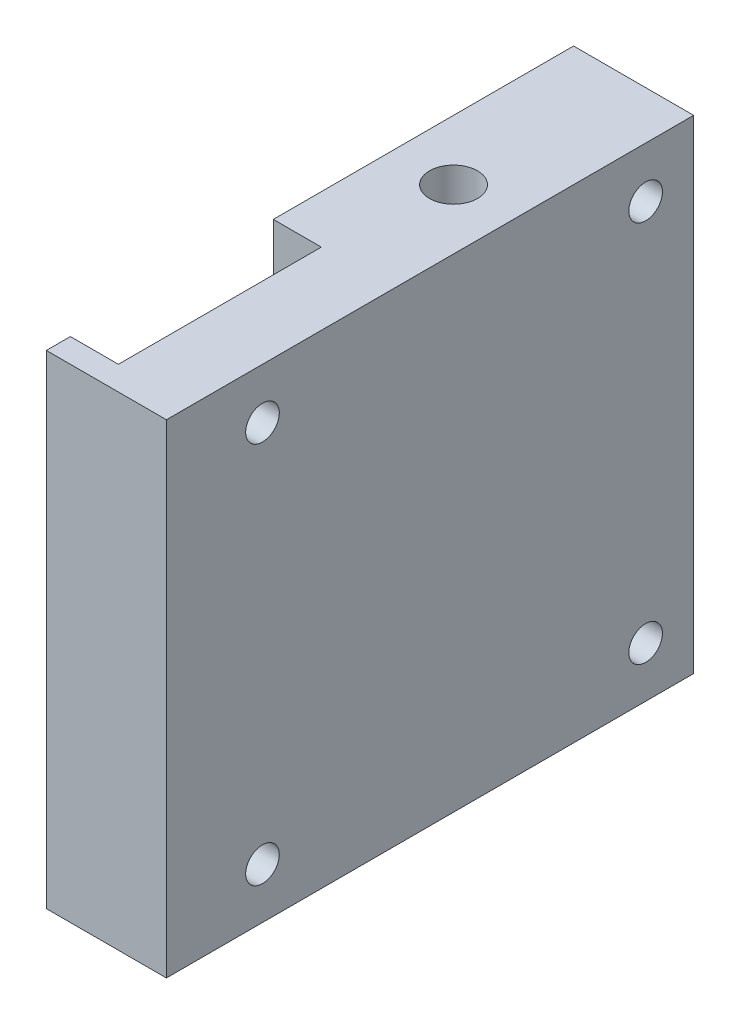
ISO-10303-21;
HEADER;
FILE_DESCRIPTION(('STEP AP214'),'2;1');
FILE_NAME('part.step','',(''),(''),'','','');
FILE_SCHEMA(('AUTOMOTIVE_DESIGN { 1 0 10303 214 1 1 1 1 }'));
ENDSEC;
DATA;
#1=APPLICATION_CONTEXT('core data for automotive mechanical design processes');
#2=APPLICATION_PROTOCOL_DEFINITION('international standard','automotive_design',2000,#1);
#3=PRODUCT_CONTEXT('',#1,'mechanical');
#4=PRODUCT('Part','Part','',(#3));
#5=PRODUCT_RELATED_PRODUCT_CATEGORY('part','',(#4));
#6=PRODUCT_DEFINITION_FORMATION('','',#4);
#7=PRODUCT_DEFINITION_CONTEXT('part definition',#1,'design');
#8=PRODUCT_DEFINITION('design','',#6,#7);
#9=PRODUCT_DEFINITION_SHAPE('','',#8);
#10=(LENGTH_UNIT() NAMED_UNIT(*) SI_UNIT(.MILLI.,.METRE.));
#11=(NAMED_UNIT(*) PLANE_ANGLE_UNIT() SI_UNIT($,.RADIAN.));
#12=(NAMED_UNIT(*) SI_UNIT($,.STERADIAN.) SOLID_ANGLE_UNIT());
#13=UNCERTAINTY_MEASURE_WITH_UNIT(LENGTH_MEASURE(1.E-05),#10,'distance_accuracy_value','');
#14=(GEOMETRIC_REPRESENTATION_CONTEXT(3) GLOBAL_UNCERTAINTY_ASSIGNED_CONTEXT((#13)) GLOBAL_UNIT_ASSIGNED_CONTEXT((#10,
#11,#12)) REPRESENTATION_CONTEXT('',''));
#15=CARTESIAN_POINT('',(0.,0.,0.));
#16=DIRECTION('',(0.,0.,1.));
#17=DIRECTION('',(1.,0.,0.));
#18=AXIS2_PLACEMENT_3D('',#15,#16,#17);
#19=CARTESIAN_POINT('',(24.4736259646391,344.184836728762,297.699454326369));
#20=DIRECTION('',(1.,0.,0.));
#21=DIRECTION('',(0.,0.,-1.));
#22=AXIS2_PLACEMENT_3D('',#19,#20,#21);
#23=CYLINDRICAL_SURFACE('',#22,1.40000000002354);
#24=CARTESIAN_POINT('',(34.4736259646391,344.184836728762,297.699454326369));
#25=DIRECTION('',(-1.,0.,0.));
#26=DIRECTION('',(0.,0.,1.));
#27=AXIS2_PLACEMENT_3D('',#24,#25,#26);
#28=CIRCLE('',#27,1.40000000002354);
#29=CARTESIAN_POINT('',(34.4736259646391,344.184836728762,299.099454326392));
#30=VERTEX_POINT('',#29);
#31=EDGE_CURVE('E187',#30,#30,#28,.T.);
#32=ORIENTED_EDGE('',*,*,#31,.F.);
#33=EDGE_LOOP('',(#32));
#34=FACE_BOUND('',#33,.T.);
#35=CARTESIAN_POINT('',(28.4736259646391,344.184836728762,297.699454326369));
#36=DIRECTION('',(-1.,0.,0.));
#37=DIRECTION('',(0.,0.,1.));
#38=AXIS2_PLACEMENT_3D('',#35,#36,#37);
#39=CIRCLE('',#38,1.40000000002354);
#40=CARTESIAN_POINT('',(28.4736259646391,344.184836728762,299.099454326392));
#41=VERTEX_POINT('',#40);
#42=EDGE_CURVE('E40',#41,#41,#39,.T.);
#43=ORIENTED_EDGE('',*,*,#42,.T.);
#44=EDGE_LOOP('',(#43));
#45=FACE_BOUND('',#44,.T.);
#46=ADVANCED_FACE('F36',(#34,#45),#23,.F.);
#47=CARTESIAN_POINT('',(24.4736259646391,312.337113745687,297.699454326369));
#48=DIRECTION('',(1.,0.,0.));
#49=DIRECTION('',(0.,0.,-1.));
#50=AXIS2_PLACEMENT_3D('',#47,#48,#49);
#51=CYLINDRICAL_SURFACE('',#50,1.40000000002354);
#52=CARTESIAN_POINT('',(34.4736259646391,312.337113745687,297.699454326369));
#53=DIRECTION('',(-1.,0.,0.));
#54=DIRECTION('',(0.,0.,-1.));
#55=AXIS2_PLACEMENT_3D('',#52,#53,#54);
#56=CIRCLE('',#55,1.40000000002354);
#57=CARTESIAN_POINT('',(34.4736259646391,312.337113745687,296.299454326345));
#58=VERTEX_POINT('',#57);
#59=EDGE_CURVE('E184',#58,#58,#56,.T.);
#60=ORIENTED_EDGE('',*,*,#59,.F.);
#61=EDGE_LOOP('',(#60));
#62=FACE_BOUND('',#61,.T.);
#63=CARTESIAN_POINT('',(28.4736259646391,312.337113745687,297.699454326369));
#64=DIRECTION('',(-1.,0.,0.));
#65=DIRECTION('',(0.,0.,1.));
#66=AXIS2_PLACEMENT_3D('',#63,#64,#65);
#67=CIRCLE('',#66,1.40000000002354);
#68=CARTESIAN_POINT('',(28.4736259646391,312.337113745687,299.099454326392));
#69=VERTEX_POINT('',#68);
#70=EDGE_CURVE('E206',#69,#69,#67,.T.);
#71=ORIENTED_EDGE('',*,*,#70,.T.);
#72=EDGE_LOOP('',(#71));
#73=FACE_BOUND('',#72,.T.);
#74=ADVANCED_FACE('F230',(#62,#73),#51,.F.);
#75=CARTESIAN_POINT('',(24.4736259646394,312.337113745687,265.79051928011));
#76=DIRECTION('',(1.,0.,0.));
#77=DIRECTION('',(0.,0.,-1.));
#78=AXIS2_PLACEMENT_3D('',#75,#76,#77);
#79=CYLINDRICAL_SURFACE('',#78,1.40000000002354);
#80=CARTESIAN_POINT('',(34.4736259646394,312.337113745687,265.79051928011));
#81=DIRECTION('',(-1.,0.,0.));
#82=DIRECTION('',(0.,0.,1.));
#83=AXIS2_PLACEMENT_3D('',#80,#81,#82);
#84=CIRCLE('',#83,1.40000000002354);
#85=CARTESIAN_POINT('',(34.4736259646394,312.337113745687,267.190519280133));
#86=VERTEX_POINT('',#85);
#87=EDGE_CURVE('E181',#86,#86,#84,.T.);
#88=ORIENTED_EDGE('',*,*,#87,.F.);
#89=EDGE_LOOP('',(#88));
#90=FACE_BOUND('',#89,.T.);
#91=CARTESIAN_POINT('',(28.4736259646394,312.337113745687,265.79051928011));
#92=DIRECTION('',(-1.,0.,0.));
#93=DIRECTION('',(0.,0.,1.));
#94=AXIS2_PLACEMENT_3D('',#91,#92,#93);
#95=CIRCLE('',#94,1.40000000002354);
#96=CARTESIAN_POINT('',(28.4736259646394,312.337113745687,267.190519280133));
#97=VERTEX_POINT('',#96);
#98=EDGE_CURVE('E204',#97,#97,#95,.T.);
#99=ORIENTED_EDGE('',*,*,#98,.T.);
#100=EDGE_LOOP('',(#99));
#101=FACE_BOUND('',#100,.T.);
#102=ADVANCED_FACE('F236',(#90,#101),#79,.F.);
#103=CARTESIAN_POINT('',(24.4736259646394,344.184836728762,265.79051928011));
#104=DIRECTION('',(1.,0.,0.));
#105=DIRECTION('',(0.,0.,-1.));
#106=AXIS2_PLACEMENT_3D('',#103,#104,#105);
#107=CYLINDRICAL_SURFACE('',#106,1.40000000002354);
#108=CARTESIAN_POINT('',(34.4736259646394,344.184836728762,265.79051928011));
#109=DIRECTION('',(-1.,0.,0.));
#110=DIRECTION('',(0.,0.,-1.));
#111=AXIS2_PLACEMENT_3D('',#108,#109,#110);
#112=CIRCLE('',#111,1.40000000002354);
#113=CARTESIAN_POINT('',(34.4736259646394,344.184836728762,264.390519280086));
#114=VERTEX_POINT('',#113);
#115=EDGE_CURVE('E178',#114,#114,#112,.T.);
#116=ORIENTED_EDGE('',*,*,#115,.F.);
#117=EDGE_LOOP('',(#116));
#118=FACE_BOUND('',#117,.T.);
#119=CARTESIAN_POINT('',(28.4736259646394,344.184836728762,265.79051928011));
#120=DIRECTION('',(-1.,0.,0.));
#121=DIRECTION('',(0.,0.,1.));
#122=AXIS2_PLACEMENT_3D('',#119,#120,#121);
#123=CIRCLE('',#122,1.40000000002354);
#124=CARTESIAN_POINT('',(28.4736259646394,344.184836728762,267.190519280133));
#125=VERTEX_POINT('',#124);
#126=EDGE_CURVE('E163',#125,#125,#123,.T.);
#127=ORIENTED_EDGE('',*,*,#126,.T.);
#128=EDGE_LOOP('',(#127));
#129=FACE_BOUND('',#128,.T.);
#130=ADVANCED_FACE('F246',(#118,#129),#107,.F.);
#131=CARTESIAN_POINT('',(24.4736259646422,0.,2.54887556189954E-13));
#132=DIRECTION('',(-1.,0.,0.));
#133=DIRECTION('',(0.,0.,1.));
#134=AXIS2_PLACEMENT_3D('',#131,#132,#133);
#135=PLANE('',#134);
#136=DIRECTION('',(0.,1.,0.));
#137=VECTOR('',#136,1.);
#138=CARTESIAN_POINT('',(24.473625964639,348.392413745696,303.699454326368));
#139=LINE('',#138,#137);
#140=CARTESIAN_POINT('',(24.473625964639,318.392413745696,303.699454326368));
#141=VERTEX_POINT('',#140);
#142=CARTESIAN_POINT('',(24.473625964639,348.392413745696,303.699454326368));
#143=VERTEX_POINT('',#142);
#144=EDGE_CURVE('E124',#141,#143,#139,.T.);
#145=ORIENTED_EDGE('',*,*,#144,.F.);
#146=DIRECTION('',(0.,0.,1.));
#147=VECTOR('',#146,1.);
#148=CARTESIAN_POINT('',(24.4736259646392,318.392413745696,286.799454326369));
#149=LINE('',#148,#147);
#150=CARTESIAN_POINT('',(24.4736259646392,318.392413745696,286.799454326369));
#151=VERTEX_POINT('',#150);
#152=EDGE_CURVE('E156',#151,#141,#149,.T.);
#153=ORIENTED_EDGE('',*,*,#152,.F.);
#154=DIRECTION('',(0.,-1.,0.));
#155=VECTOR('',#154,1.);
#156=CARTESIAN_POINT('',(24.4736259646392,348.392413745696,286.799454326369));
#157=LINE('',#156,#155);
#158=CARTESIAN_POINT('',(24.4736259646392,348.392413745696,286.799454326369));
#159=VERTEX_POINT('',#158);
#160=EDGE_CURVE('E149',#159,#151,#157,.T.);
#161=ORIENTED_EDGE('',*,*,#160,.F.);
#162=DIRECTION('',(0.,0.,-1.));
#163=VECTOR('',#162,1.);
#164=CARTESIAN_POINT('',(24.4736259646395,348.392413745696,261.79051928011));
#165=LINE('',#164,#163);
#166=CARTESIAN_POINT('',(24.4736259646395,348.392413745696,261.79051928011));
#167=VERTEX_POINT('',#166);
#168=EDGE_CURVE('E190',#159,#167,#165,.T.);
#169=ORIENTED_EDGE('',*,*,#168,.T.);
#170=DIRECTION('',(0.,-1.,0.));
#171=VECTOR('',#170,1.);
#172=CARTESIAN_POINT('',(24.4736259646395,348.392413745696,261.79051928011));
#173=LINE('',#172,#171);
#174=CARTESIAN_POINT('',(24.4736259646395,308.129536728753,261.79051928011));
#175=VERTEX_POINT('',#174);
#176=EDGE_CURVE('E55',#167,#175,#173,.T.);
#177=ORIENTED_EDGE('',*,*,#176,.T.);
#178=DIRECTION('',(0.,0.,1.));
#179=VECTOR('',#178,1.);
#180=CARTESIAN_POINT('',(24.4736259646395,308.129536728753,261.79051928011));
#181=LINE('',#180,#179);
#182=CARTESIAN_POINT('',(24.473625964639,308.129536728753,305.699454326368));
#183=VERTEX_POINT('',#182);
#184=EDGE_CURVE('E194',#175,#183,#181,.T.);
#185=ORIENTED_EDGE('',*,*,#184,.T.);
#186=DIRECTION('',(0.,-1.,0.));
#187=VECTOR('',#186,1.);
#188=CARTESIAN_POINT('',(24.473625964639,308.129536728753,305.699454326368));
#189=LINE('',#188,#187);
#190=CARTESIAN_POINT('',(24.473625964639,348.392413745696,305.699454326368));
#191=VERTEX_POINT('',#190);
#192=EDGE_CURVE('E135',#191,#183,#189,.T.);
#193=ORIENTED_EDGE('',*,*,#192,.F.);
#194=DIRECTION('',(0.,0.,-1.));
#195=VECTOR('',#194,1.);
#196=CARTESIAN_POINT('',(24.473625964639,348.392413745696,305.699454326368));
#197=LINE('',#196,#195);
#198=EDGE_CURVE('E147',#191,#143,#197,.T.);
#199=ORIENTED_EDGE('',*,*,#198,.T.);
#200=EDGE_LOOP('',(#145,#153,#161,#169,#177,#185,#193,#199));
#201=FACE_BOUND('',#200,.T.);
#202=CARTESIAN_POINT('',(24.4736259646394,344.184836728762,265.79051928011));
#203=DIRECTION('',(-1.,0.,0.));
#204=DIRECTION('',(0.,0.,1.));
#205=AXIS2_PLACEMENT_3D('',#202,#203,#204);
#206=CIRCLE('',#205,2.99999999999999);
#207=CARTESIAN_POINT('',(24.4736259646394,344.184836728762,268.79051928011));
#208=VERTEX_POINT('',#207);
#209=EDGE_CURVE('E173',#208,#208,#206,.T.);
#210=ORIENTED_EDGE('',*,*,#209,.F.);
#211=EDGE_LOOP('',(#210));
#212=FACE_BOUND('',#211,.T.);
#213=CARTESIAN_POINT('',(24.4736259646394,312.337113745687,265.79051928011));
#214=DIRECTION('',(-1.,0.,0.));
#215=DIRECTION('',(0.,0.,1.));
#216=AXIS2_PLACEMENT_3D('',#213,#214,#215);
#217=CIRCLE('',#216,2.99999999999999);
#218=CARTESIAN_POINT('',(24.4736259646394,312.337113745687,268.79051928011));
#219=VERTEX_POINT('',#218);
#220=EDGE_CURVE('E167',#219,#219,#217,.T.);
#221=ORIENTED_EDGE('',*,*,#220,.F.);
#222=EDGE_LOOP('',(#221));
#223=FACE_BOUND('',#222,.T.);
#224=CARTESIAN_POINT('',(24.4736259646391,312.337113745687,297.699454326369));
#225=DIRECTION('',(-1.,0.,0.));
#226=DIRECTION('',(0.,0.,1.));
#227=AXIS2_PLACEMENT_3D('',#224,#225,#226);
#228=CIRCLE('',#227,2.99999999999999);
#229=CARTESIAN_POINT('',(24.4736259646391,312.337113745687,300.699454326369));
#230=VERTEX_POINT('',#229);
#231=EDGE_CURVE('E160',#230,#230,#228,.T.);
#232=ORIENTED_EDGE('',*,*,#231,.F.);
#233=EDGE_LOOP('',(#232));
#234=FACE_BOUND('',#233,.T.);
#235=ADVANCED_FACE('F242',(#201,#212,#223,#234),#135,.T.);
#236=CARTESIAN_POINT('',(34.4736259646422,0.,3.59631996355248E-13));
#237=DIRECTION('',(-1.,0.,0.));
#238=DIRECTION('',(0.,0.,1.));
#239=AXIS2_PLACEMENT_3D('',#236,#237,#238);
#240=PLANE('',#239);
#241=DIRECTION('',(0.,0.,-1.));
#242=VECTOR('',#241,1.);
#243=CARTESIAN_POINT('',(34.4736259646395,348.392413745696,261.79051928011));
#244=LINE('',#243,#242);
#245=CARTESIAN_POINT('',(34.473625964639,348.392413745696,305.699454326368));
#246=VERTEX_POINT('',#245);
#247=CARTESIAN_POINT('',(34.4736259646395,348.392413745696,261.79051928011));
#248=VERTEX_POINT('',#247);
#249=EDGE_CURVE('E66',#246,#248,#244,.T.);
#250=ORIENTED_EDGE('',*,*,#249,.F.);
#251=DIRECTION('',(0.,1.,0.));
#252=VECTOR('',#251,1.);
#253=CARTESIAN_POINT('',(34.473625964639,308.129536728753,305.699454326368));
#254=LINE('',#253,#252);
#255=CARTESIAN_POINT('',(34.473625964639,308.129536728753,305.699454326368));
#256=VERTEX_POINT('',#255);
#257=EDGE_CURVE('E142',#256,#246,#254,.T.);
#258=ORIENTED_EDGE('',*,*,#257,.F.);
#259=DIRECTION('',(0.,0.,1.));
#260=VECTOR('',#259,1.);
#261=CARTESIAN_POINT('',(34.4736259646395,308.129536728753,261.79051928011));
#262=LINE('',#261,#260);
#263=CARTESIAN_POINT('',(34.4736259646395,308.129536728753,261.79051928011));
#264=VERTEX_POINT('',#263);
#265=EDGE_CURVE('E192',#264,#256,#262,.T.);
#266=ORIENTED_EDGE('',*,*,#265,.F.);
#267=DIRECTION('',(0.,-1.,0.));
#268=VECTOR('',#267,1.);
#269=CARTESIAN_POINT('',(34.4736259646395,348.392413745696,261.79051928011));
#270=LINE('',#269,#268);
#271=EDGE_CURVE('E197',#248,#264,#270,.T.);
#272=ORIENTED_EDGE('',*,*,#271,.F.);
#273=EDGE_LOOP('',(#250,#258,#266,#272));
#274=FACE_BOUND('',#273,.T.);
#275=ORIENTED_EDGE('',*,*,#31,.T.);
#276=EDGE_LOOP('',(#275));
#277=FACE_BOUND('',#276,.T.);
#278=ORIENTED_EDGE('',*,*,#59,.T.);
#279=EDGE_LOOP('',(#278));
#280=FACE_BOUND('',#279,.T.);
#281=ORIENTED_EDGE('',*,*,#87,.T.);
#282=EDGE_LOOP('',(#281));
#283=FACE_BOUND('',#282,.T.);
#284=ORIENTED_EDGE('',*,*,#115,.T.);
#285=EDGE_LOOP('',(#284));
#286=FACE_BOUND('',#285,.T.);
#287=ADVANCED_FACE('F245',(#274,#277,#280,#283,#286),#240,.F.);
#288=CARTESIAN_POINT('',(24.4736259646395,348.392413745696,261.79051928011));
#289=DIRECTION('',(0.,-1.,0.));
#290=DIRECTION('',(1.,0.,0.));
#291=AXIS2_PLACEMENT_3D('',#288,#289,#290);
#292=PLANE('',#291);
#293=CARTESIAN_POINT('',(29.473625964639,348.392413745696,276.79051928011));
#294=DIRECTION('',(0.,1.,0.));
#295=DIRECTION('',(-1.,0.,0.));
#296=AXIS2_PLACEMENT_3D('',#293,#294,#295);
#297=CIRCLE('',#296,2.00000000000001);
#298=CARTESIAN_POINT('',(27.473625964639,348.392413745696,276.79051928011));
#299=VERTEX_POINT('',#298);
#300=EDGE_CURVE('E132',#299,#299,#297,.T.);
#301=ORIENTED_EDGE('',*,*,#300,.F.);
#302=EDGE_LOOP('',(#301));
#303=FACE_BOUND('',#302,.T.);
#304=DIRECTION('',(0.,0.,1.));
#305=VECTOR('',#304,1.);
#306=CARTESIAN_POINT('',(28.4736259646392,348.392413745696,286.799454326369));
#307=LINE('',#306,#305);
#308=CARTESIAN_POINT('',(28.4736259646391,348.392413745696,286.799454326369));
#309=VERTEX_POINT('',#308);
#310=CARTESIAN_POINT('',(28.473625964639,348.392413745696,303.699454326368));
#311=VERTEX_POINT('',#310);
#312=EDGE_CURVE('E107',#309,#311,#307,.T.);
#313=ORIENTED_EDGE('',*,*,#312,.T.);
#314=DIRECTION('',(-1.,0.,0.));
#315=VECTOR('',#314,1.);
#316=CARTESIAN_POINT('',(28.473625964639,348.392413745696,303.699454326368));
#317=LINE('',#316,#315);
#318=EDGE_CURVE('E110',#311,#143,#317,.T.);
#319=ORIENTED_EDGE('',*,*,#318,.T.);
#320=ORIENTED_EDGE('',*,*,#198,.F.);
#321=DIRECTION('',(-1.,0.,0.));
#322=VECTOR('',#321,1.);
#323=CARTESIAN_POINT('',(24.473625964639,348.392413745696,305.699454326368));
#324=LINE('',#323,#322);
#325=EDGE_CURVE('E145',#246,#191,#324,.T.);
#326=ORIENTED_EDGE('',*,*,#325,.F.);
#327=ORIENTED_EDGE('',*,*,#249,.T.);
#328=DIRECTION('',(1.,0.,0.));
#329=VECTOR('',#328,1.);
#330=CARTESIAN_POINT('',(24.4736259646395,348.392413745696,261.79051928011));
#331=LINE('',#330,#329);
#332=EDGE_CURVE('E11',#167,#248,#331,.T.);
#333=ORIENTED_EDGE('',*,*,#332,.F.);
#334=ORIENTED_EDGE('',*,*,#168,.F.);
#335=DIRECTION('',(-1.,0.,0.));
#336=VECTOR('',#335,1.);
#337=CARTESIAN_POINT('',(61.9700436835535,348.392413745696,286.799454326369));
#338=LINE('',#337,#336);
#339=EDGE_CURVE('E113',#309,#159,#338,.T.);
#340=ORIENTED_EDGE('',*,*,#339,.F.);
#341=EDGE_LOOP('',(#313,#319,#320,#326,#327,#333,#334,#340));
#342=FACE_BOUND('',#341,.T.);
#343=ADVANCED_FACE('F38',(#303,#342),#292,.F.);
#344=CARTESIAN_POINT('',(24.4736259646395,348.392413745696,261.79051928011));
#345=DIRECTION('',(0.,0.,1.));
#346=DIRECTION('',(1.,0.,0.));
#347=AXIS2_PLACEMENT_3D('',#344,#345,#346);
#348=PLANE('',#347);
#349=ORIENTED_EDGE('',*,*,#271,.T.);
#350=DIRECTION('',(1.,0.,0.));
#351=VECTOR('',#350,1.);
#352=CARTESIAN_POINT('',(24.4736259646395,308.129536728753,261.79051928011));
#353=LINE('',#352,#351);
#354=EDGE_CURVE('E46',#175,#264,#353,.T.);
#355=ORIENTED_EDGE('',*,*,#354,.F.);
#356=ORIENTED_EDGE('',*,*,#176,.F.);
#357=ORIENTED_EDGE('',*,*,#332,.T.);
#358=EDGE_LOOP('',(#349,#355,#356,#357));
#359=FACE_BOUND('',#358,.T.);
#360=ADVANCED_FACE('F253',(#359),#348,.F.);
#361=CARTESIAN_POINT('',(24.4736259646395,308.129536728753,261.79051928011));
#362=DIRECTION('',(0.,1.,0.));
#363=DIRECTION('',(-1.,0.,0.));
#364=AXIS2_PLACEMENT_3D('',#361,#362,#363);
#365=PLANE('',#364);
#366=ORIENTED_EDGE('',*,*,#265,.T.);
#367=DIRECTION('',(1.,0.,0.));
#368=VECTOR('',#367,1.);
#369=CARTESIAN_POINT('',(24.473625964639,308.129536728753,305.699454326368));
#370=LINE('',#369,#368);
#371=EDGE_CURVE('E139',#183,#256,#370,.T.);
#372=ORIENTED_EDGE('',*,*,#371,.F.);
#373=ORIENTED_EDGE('',*,*,#184,.F.);
#374=ORIENTED_EDGE('',*,*,#354,.T.);
#375=EDGE_LOOP('',(#366,#372,#373,#374));
#376=FACE_BOUND('',#375,.T.);
#377=ADVANCED_FACE('F250',(#376),#365,.F.);
#378=CARTESIAN_POINT('',(28.4736259646394,344.184836728762,265.79051928011));
#379=DIRECTION('',(-1.,0.,0.));
#380=DIRECTION('',(0.,0.,1.));
#381=AXIS2_PLACEMENT_3D('',#378,#379,#380);
#382=CYLINDRICAL_SURFACE('',#381,2.99999999999999);
#383=CARTESIAN_POINT('',(28.4736259646394,344.184836728762,265.79051928011));
#384=DIRECTION('',(-1.,0.,0.));
#385=DIRECTION('',(0.,0.,1.));
#386=AXIS2_PLACEMENT_3D('',#383,#384,#385);
#387=CIRCLE('',#386,2.99999999999999);
#388=CARTESIAN_POINT('',(28.4736259646394,344.184836728762,268.79051928011));
#389=VERTEX_POINT('',#388);
#390=EDGE_CURVE('E116',#389,#389,#387,.T.);
#391=ORIENTED_EDGE('',*,*,#390,.F.);
#392=EDGE_LOOP('',(#391));
#393=FACE_BOUND('',#392,.T.);
#394=ORIENTED_EDGE('',*,*,#209,.T.);
#395=EDGE_LOOP('',(#394));
#396=FACE_BOUND('',#395,.T.);
#397=ADVANCED_FACE('F252',(#393,#396),#382,.F.);
#398=CARTESIAN_POINT('',(28.4736259646394,344.184836728762,265.79051928011));
#399=DIRECTION('',(-1.,0.,0.));
#400=DIRECTION('',(0.,0.,1.));
#401=AXIS2_PLACEMENT_3D('',#398,#399,#400);
#402=PLANE('',#401);
#403=ORIENTED_EDGE('',*,*,#126,.F.);
#404=EDGE_LOOP('',(#403));
#405=FACE_BOUND('',#404,.T.);
#406=ORIENTED_EDGE('',*,*,#390,.T.);
#407=EDGE_LOOP('',(#406));
#408=FACE_BOUND('',#407,.T.);
#409=ADVANCED_FACE('F292',(#405,#408),#402,.T.);
#410=CARTESIAN_POINT('',(28.4736259646394,312.337113745687,265.79051928011));
#411=DIRECTION('',(-1.,0.,0.));
#412=DIRECTION('',(0.,0.,1.));
#413=AXIS2_PLACEMENT_3D('',#410,#411,#412);
#414=CYLINDRICAL_SURFACE('',#413,2.99999999999999);
#415=CARTESIAN_POINT('',(28.4736259646394,312.337113745687,265.79051928011));
#416=DIRECTION('',(-1.,0.,0.));
#417=DIRECTION('',(0.,0.,1.));
#418=AXIS2_PLACEMENT_3D('',#415,#416,#417);
#419=CIRCLE('',#418,2.99999999999999);
#420=CARTESIAN_POINT('',(28.4736259646394,312.337113745687,268.79051928011));
#421=VERTEX_POINT('',#420);
#422=EDGE_CURVE('E170',#421,#421,#419,.T.);
#423=ORIENTED_EDGE('',*,*,#422,.F.);
#424=EDGE_LOOP('',(#423));
#425=FACE_BOUND('',#424,.T.);
#426=ORIENTED_EDGE('',*,*,#220,.T.);
#427=EDGE_LOOP('',(#426));
#428=FACE_BOUND('',#427,.T.);
#429=ADVANCED_FACE('F285',(#425,#428),#414,.F.);
#430=CARTESIAN_POINT('',(28.4736259646394,312.337113745687,265.79051928011));
#431=DIRECTION('',(-1.,0.,0.));
#432=DIRECTION('',(0.,0.,1.));
#433=AXIS2_PLACEMENT_3D('',#430,#431,#432);
#434=PLANE('',#433);
#435=ORIENTED_EDGE('',*,*,#98,.F.);
#436=EDGE_LOOP('',(#435));
#437=FACE_BOUND('',#436,.T.);
#438=ORIENTED_EDGE('',*,*,#422,.T.);
#439=EDGE_LOOP('',(#438));
#440=FACE_BOUND('',#439,.T.);
#441=ADVANCED_FACE('F279',(#437,#440),#434,.T.);
#442=CARTESIAN_POINT('',(28.4736259646391,312.337113745687,297.699454326369));
#443=DIRECTION('',(-1.,0.,0.));
#444=DIRECTION('',(0.,0.,1.));
#445=AXIS2_PLACEMENT_3D('',#442,#443,#444);
#446=CYLINDRICAL_SURFACE('',#445,2.99999999999999);
#447=CARTESIAN_POINT('',(28.4736259646391,312.337113745687,297.699454326369));
#448=DIRECTION('',(-1.,0.,0.));
#449=DIRECTION('',(0.,0.,1.));
#450=AXIS2_PLACEMENT_3D('',#447,#448,#449);
#451=CIRCLE('',#450,2.99999999999999);
#452=CARTESIAN_POINT('',(28.4736259646391,312.337113745687,300.699454326369));
#453=VERTEX_POINT('',#452);
#454=EDGE_CURVE('E164',#453,#453,#451,.T.);
#455=ORIENTED_EDGE('',*,*,#454,.F.);
#456=EDGE_LOOP('',(#455));
#457=FACE_BOUND('',#456,.T.);
#458=ORIENTED_EDGE('',*,*,#231,.T.);
#459=EDGE_LOOP('',(#458));
#460=FACE_BOUND('',#459,.T.);
#461=ADVANCED_FACE('F224',(#457,#460),#446,.F.);
#462=CARTESIAN_POINT('',(28.4736259646391,312.337113745687,297.699454326369));
#463=DIRECTION('',(-1.,0.,0.));
#464=DIRECTION('',(0.,0.,1.));
#465=AXIS2_PLACEMENT_3D('',#462,#463,#464);
#466=PLANE('',#465);
#467=ORIENTED_EDGE('',*,*,#70,.F.);
#468=EDGE_LOOP('',(#467));
#469=FACE_BOUND('',#468,.T.);
#470=ORIENTED_EDGE('',*,*,#454,.T.);
#471=EDGE_LOOP('',(#470));
#472=FACE_BOUND('',#471,.T.);
#473=ADVANCED_FACE('F216',(#469,#472),#466,.T.);
#474=CARTESIAN_POINT('',(28.4736259646391,344.074881584618,297.699454326369));
#475=DIRECTION('',(-1.,0.,0.));
#476=DIRECTION('',(0.,0.,1.));
#477=AXIS2_PLACEMENT_3D('',#474,#475,#476);
#478=PLANE('',#477);
#479=ORIENTED_EDGE('',*,*,#42,.F.);
#480=EDGE_LOOP('',(#479));
#481=FACE_BOUND('',#480,.T.);
#482=DIRECTION('',(0.,0.,-1.));
#483=VECTOR('',#482,1.);
#484=CARTESIAN_POINT('',(28.4736259646392,318.392413745696,286.799454326369));
#485=LINE('',#484,#483);
#486=CARTESIAN_POINT('',(28.473625964639,318.392413745696,303.699454326368));
#487=VERTEX_POINT('',#486);
#488=CARTESIAN_POINT('',(28.4736259646392,318.392413745696,286.799454326369));
#489=VERTEX_POINT('',#488);
#490=EDGE_CURVE('E74',#487,#489,#485,.T.);
#491=ORIENTED_EDGE('',*,*,#490,.F.);
#492=DIRECTION('',(0.,1.,0.));
#493=VECTOR('',#492,1.);
#494=CARTESIAN_POINT('',(28.473625964639,348.392413745696,303.699454326368));
#495=LINE('',#494,#493);
#496=EDGE_CURVE('E122',#487,#311,#495,.T.);
#497=ORIENTED_EDGE('',*,*,#496,.T.);
#498=ORIENTED_EDGE('',*,*,#312,.F.);
#499=DIRECTION('',(0.,1.,0.));
#500=VECTOR('',#499,1.);
#501=CARTESIAN_POINT('',(28.4736259646392,348.392413745696,286.799454326369));
#502=LINE('',#501,#500);
#503=EDGE_CURVE('E150',#489,#309,#502,.T.);
#504=ORIENTED_EDGE('',*,*,#503,.F.);
#505=EDGE_LOOP('',(#491,#497,#498,#504));
#506=FACE_BOUND('',#505,.T.);
#507=ADVANCED_FACE('F127',(#481,#506),#478,.T.);
#508=CARTESIAN_POINT('',(61.9700436835535,318.392413745696,286.799454326369));
#509=DIRECTION('',(0.,-1.,0.));
#510=DIRECTION('',(0.,0.,-1.));
#511=AXIS2_PLACEMENT_3D('',#508,#509,#510);
#512=PLANE('',#511);
#513=ORIENTED_EDGE('',*,*,#490,.T.);
#514=DIRECTION('',(-1.,0.,0.));
#515=VECTOR('',#514,1.);
#516=CARTESIAN_POINT('',(61.9700436835535,318.392413745696,286.799454326369));
#517=LINE('',#516,#515);
#518=EDGE_CURVE('E152',#489,#151,#517,.T.);
#519=ORIENTED_EDGE('',*,*,#518,.T.);
#520=ORIENTED_EDGE('',*,*,#152,.T.);
#521=DIRECTION('',(-1.,0.,0.));
#522=VECTOR('',#521,1.);
#523=CARTESIAN_POINT('',(28.473625964639,318.392413745696,303.699454326368));
#524=LINE('',#523,#522);
#525=EDGE_CURVE('E125',#487,#141,#524,.T.);
#526=ORIENTED_EDGE('',*,*,#525,.F.);
#527=EDGE_LOOP('',(#513,#519,#520,#526));
#528=FACE_BOUND('',#527,.T.);
#529=ADVANCED_FACE('F215',(#528),#512,.F.);
#530=CARTESIAN_POINT('',(61.9700436835535,348.392413745696,286.799454326369));
#531=DIRECTION('',(0.,0.,-1.));
#532=DIRECTION('',(-1.,0.,0.));
#533=AXIS2_PLACEMENT_3D('',#530,#531,#532);
#534=PLANE('',#533);
#535=ORIENTED_EDGE('',*,*,#503,.T.);
#536=ORIENTED_EDGE('',*,*,#339,.T.);
#537=ORIENTED_EDGE('',*,*,#160,.T.);
#538=ORIENTED_EDGE('',*,*,#518,.F.);
#539=EDGE_LOOP('',(#535,#536,#537,#538));
#540=FACE_BOUND('',#539,.T.);
#541=ADVANCED_FACE('F222',(#540),#534,.F.);
#542=CARTESIAN_POINT('',(0.,0.,305.699454326368));
#543=DIRECTION('',(0.,0.,-1.));
#544=DIRECTION('',(-1.,0.,0.));
#545=AXIS2_PLACEMENT_3D('',#542,#543,#544);
#546=PLANE('',#545);
#547=ORIENTED_EDGE('',*,*,#192,.T.);
#548=ORIENTED_EDGE('',*,*,#371,.T.);
#549=ORIENTED_EDGE('',*,*,#257,.T.);
#550=ORIENTED_EDGE('',*,*,#325,.T.);
#551=EDGE_LOOP('',(#547,#548,#549,#550));
#552=FACE_BOUND('',#551,.T.);
#553=ADVANCED_FACE('F268',(#552),#546,.F.);
#554=CARTESIAN_POINT('',(28.473625964639,348.392413745696,303.699454326368));
#555=DIRECTION('',(0.,0.,1.));
#556=DIRECTION('',(1.,0.,0.));
#557=AXIS2_PLACEMENT_3D('',#554,#555,#556);
#558=PLANE('',#557);
#559=ORIENTED_EDGE('',*,*,#144,.T.);
#560=ORIENTED_EDGE('',*,*,#318,.F.);
#561=ORIENTED_EDGE('',*,*,#496,.F.);
#562=ORIENTED_EDGE('',*,*,#525,.T.);
#563=EDGE_LOOP('',(#559,#560,#561,#562));
#564=FACE_BOUND('',#563,.T.);
#565=ADVANCED_FACE('F120',(#564),#558,.F.);
#566=CARTESIAN_POINT('',(29.473625964639,342.392413745696,276.79051928011));
#567=DIRECTION('',(0.,1.,0.));
#568=DIRECTION('',(-1.,0.,0.));
#569=AXIS2_PLACEMENT_3D('',#566,#567,#568);
#570=CYLINDRICAL_SURFACE('',#569,2.00000000000001);
#571=CARTESIAN_POINT('',(29.473625964639,342.392413745696,276.79051928011));
#572=DIRECTION('',(0.,1.,0.));
#573=DIRECTION('',(-1.,0.,0.));
#574=AXIS2_PLACEMENT_3D('',#571,#572,#573);
#575=CIRCLE('',#574,2.00000000000001);
#576=CARTESIAN_POINT('',(27.473625964639,342.392413745696,276.79051928011));
#577=VERTEX_POINT('',#576);
#578=EDGE_CURVE('E129',#577,#577,#575,.T.);
#579=ORIENTED_EDGE('',*,*,#578,.F.);
#580=EDGE_LOOP('',(#579));
#581=FACE_BOUND('',#580,.T.);
#582=ORIENTED_EDGE('',*,*,#300,.T.);
#583=EDGE_LOOP('',(#582));
#584=FACE_BOUND('',#583,.T.);
#585=ADVANCED_FACE('F468',(#581,#584),#570,.F.);
#586=CARTESIAN_POINT('',(29.473625964639,342.392413745696,276.79051928011));
#587=DIRECTION('',(0.,1.,0.));
#588=DIRECTION('',(-1.,0.,0.));
#589=AXIS2_PLACEMENT_3D('',#586,#587,#588);
#590=PLANE('',#589);
#591=ORIENTED_EDGE('',*,*,#578,.T.);
#592=EDGE_LOOP('',(#591));
#593=FACE_BOUND('',#592,.T.);
#594=ADVANCED_FACE('F473',(#593),#590,.T.);
#595=CLOSED_SHELL('',(#46,#74,#102,#130,#235,#287,#343,#360,#377,#397,#409,#429,#441,#461,#473,
#507,#529,#541,#553,#565,#585,#594));
#596=MANIFOLD_SOLID_BREP('B2',#595);
#597=ADVANCED_BREP_SHAPE_REPRESENTATION('',(#18,#596),#14);
#598=SHAPE_DEFINITION_REPRESENTATION(#9,#597);
ENDSEC;
END-ISO-10303-21;
